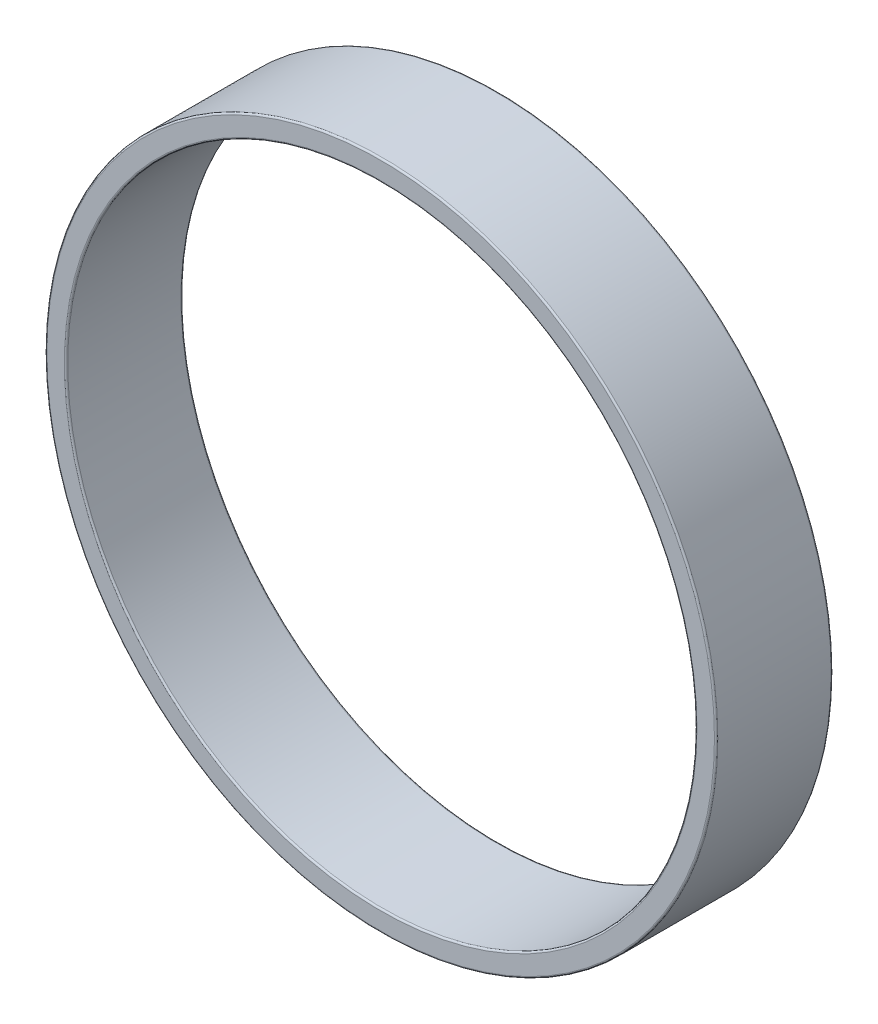
ISO-10303-21;
HEADER;
FILE_DESCRIPTION(('STEP AP214'),'2;1');
FILE_NAME('part.step','',(''),(''),'','','');
FILE_SCHEMA(('AUTOMOTIVE_DESIGN { 1 0 10303 214 1 1 1 1 }'));
ENDSEC;
DATA;
#1=APPLICATION_CONTEXT('core data for automotive mechanical design processes');
#2=APPLICATION_PROTOCOL_DEFINITION('international standard','automotive_design',2000,#1);
#3=PRODUCT_CONTEXT('',#1,'mechanical');
#4=PRODUCT('Part','Part','',(#3));
#5=PRODUCT_RELATED_PRODUCT_CATEGORY('part','',(#4));
#6=PRODUCT_DEFINITION_FORMATION('','',#4);
#7=PRODUCT_DEFINITION_CONTEXT('part definition',#1,'design');
#8=PRODUCT_DEFINITION('design','',#6,#7);
#9=PRODUCT_DEFINITION_SHAPE('','',#8);
#10=(LENGTH_UNIT() NAMED_UNIT(*) SI_UNIT(.MILLI.,.METRE.));
#11=(NAMED_UNIT(*) PLANE_ANGLE_UNIT() SI_UNIT($,.RADIAN.));
#12=(NAMED_UNIT(*) SI_UNIT($,.STERADIAN.) SOLID_ANGLE_UNIT());
#13=UNCERTAINTY_MEASURE_WITH_UNIT(LENGTH_MEASURE(1.E-05),#10,'distance_accuracy_value','');
#14=(GEOMETRIC_REPRESENTATION_CONTEXT(3) GLOBAL_UNCERTAINTY_ASSIGNED_CONTEXT((#13)) GLOBAL_UNIT_ASSIGNED_CONTEXT((#10,
#11,#12)) REPRESENTATION_CONTEXT('',''));
#15=CARTESIAN_POINT('',(0.,0.,0.));
#16=DIRECTION('',(0.,0.,1.));
#17=DIRECTION('',(1.,0.,0.));
#18=AXIS2_PLACEMENT_3D('',#15,#16,#17);
#19=CARTESIAN_POINT('',(0.,0.,28.));
#20=DIRECTION('',(0.,0.,1.));
#21=DIRECTION('',(1.,0.,0.));
#22=AXIS2_PLACEMENT_3D('',#19,#20,#21);
#23=PLANE('',#22);
#24=CARTESIAN_POINT('',(0.,0.,28.));
#25=DIRECTION('',(0.,0.,1.));
#26=DIRECTION('',(1.,0.,0.));
#27=AXIS2_PLACEMENT_3D('',#24,#25,#26);
#28=CIRCLE('',#27,75.9);
#29=CARTESIAN_POINT('',(75.9,0.,28.));
#30=VERTEX_POINT('',#29);
#31=EDGE_CURVE('E46',#30,#30,#28,.F.);
#32=ORIENTED_EDGE('',*,*,#31,.T.);
#33=EDGE_LOOP('',(#32));
#34=FACE_BOUND('',#33,.T.);
#35=CARTESIAN_POINT('',(0.,0.,28.));
#36=DIRECTION('',(0.,0.,1.));
#37=DIRECTION('',(1.,0.,0.));
#38=AXIS2_PLACEMENT_3D('',#35,#36,#37);
#39=CIRCLE('',#38,80.1);
#40=CARTESIAN_POINT('',(80.1,0.,28.));
#41=VERTEX_POINT('',#40);
#42=EDGE_CURVE('E50',#41,#41,#39,.T.);
#43=ORIENTED_EDGE('',*,*,#42,.T.);
#44=EDGE_LOOP('',(#43));
#45=FACE_BOUND('',#44,.T.);
#46=ADVANCED_FACE('F35',(#34,#45),#23,.T.);
#47=CARTESIAN_POINT('',(0.,0.,0.));
#48=DIRECTION('',(0.,0.,1.));
#49=DIRECTION('',(1.,0.,0.));
#50=AXIS2_PLACEMENT_3D('',#47,#48,#49);
#51=PLANE('',#50);
#52=CARTESIAN_POINT('',(0.,0.,0.));
#53=DIRECTION('',(0.,0.,1.));
#54=DIRECTION('',(1.,0.,0.));
#55=AXIS2_PLACEMENT_3D('',#52,#53,#54);
#56=CIRCLE('',#55,75.9);
#57=CARTESIAN_POINT('',(75.9,0.,0.));
#58=VERTEX_POINT('',#57);
#59=EDGE_CURVE('E61',#58,#58,#56,.T.);
#60=ORIENTED_EDGE('',*,*,#59,.T.);
#61=EDGE_LOOP('',(#60));
#62=FACE_BOUND('',#61,.T.);
#63=CARTESIAN_POINT('',(0.,0.,0.));
#64=DIRECTION('',(0.,0.,1.));
#65=DIRECTION('',(1.,0.,0.));
#66=AXIS2_PLACEMENT_3D('',#63,#64,#65);
#67=CIRCLE('',#66,80.1);
#68=CARTESIAN_POINT('',(80.1,0.,0.));
#69=VERTEX_POINT('',#68);
#70=EDGE_CURVE('E64',#69,#69,#67,.F.);
#71=ORIENTED_EDGE('',*,*,#70,.T.);
#72=EDGE_LOOP('',(#71));
#73=FACE_BOUND('',#72,.T.);
#74=ADVANCED_FACE('F68',(#62,#73),#51,.F.);
#75=CARTESIAN_POINT('',(0.,0.,28.));
#76=DIRECTION('',(0.,0.,-1.));
#77=DIRECTION('',(-1.,0.,0.));
#78=AXIS2_PLACEMENT_3D('',#75,#76,#77);
#79=CYLINDRICAL_SURFACE('',#78,80.5);
#80=CARTESIAN_POINT('',(0.,0.,0.400000000000001));
#81=DIRECTION('',(0.,0.,1.));
#82=DIRECTION('',(1.,0.,0.));
#83=AXIS2_PLACEMENT_3D('',#80,#81,#82);
#84=CIRCLE('',#83,80.5);
#85=CARTESIAN_POINT('',(80.5,0.,0.400000000000001));
#86=VERTEX_POINT('',#85);
#87=EDGE_CURVE('E10',#86,#86,#84,.T.);
#88=ORIENTED_EDGE('',*,*,#87,.T.);
#89=EDGE_LOOP('',(#88));
#90=FACE_BOUND('',#89,.T.);
#91=CARTESIAN_POINT('',(0.,0.,27.6));
#92=DIRECTION('',(0.,0.,1.));
#93=DIRECTION('',(1.,0.,0.));
#94=AXIS2_PLACEMENT_3D('',#91,#92,#93);
#95=CIRCLE('',#94,80.5);
#96=CARTESIAN_POINT('',(80.5,0.,27.6));
#97=VERTEX_POINT('',#96);
#98=EDGE_CURVE('E42',#97,#97,#95,.F.);
#99=ORIENTED_EDGE('',*,*,#98,.T.);
#100=EDGE_LOOP('',(#99));
#101=FACE_BOUND('',#100,.T.);
#102=ADVANCED_FACE('F88',(#90,#101),#79,.T.);
#103=CARTESIAN_POINT('',(0.,0.,28.));
#104=DIRECTION('',(0.,0.,-1.));
#105=DIRECTION('',(-1.,0.,0.));
#106=AXIS2_PLACEMENT_3D('',#103,#104,#105);
#107=CYLINDRICAL_SURFACE('',#106,75.5);
#108=CARTESIAN_POINT('',(0.,0.,0.400000000000001));
#109=DIRECTION('',(0.,0.,1.));
#110=DIRECTION('',(1.,0.,0.));
#111=AXIS2_PLACEMENT_3D('',#108,#109,#110);
#112=CIRCLE('',#111,75.5);
#113=CARTESIAN_POINT('',(75.5,0.,0.400000000000001));
#114=VERTEX_POINT('',#113);
#115=EDGE_CURVE('E55',#114,#114,#112,.F.);
#116=ORIENTED_EDGE('',*,*,#115,.T.);
#117=EDGE_LOOP('',(#116));
#118=FACE_BOUND('',#117,.T.);
#119=CARTESIAN_POINT('',(0.,0.,27.6));
#120=DIRECTION('',(0.,0.,1.));
#121=DIRECTION('',(1.,0.,0.));
#122=AXIS2_PLACEMENT_3D('',#119,#120,#121);
#123=CIRCLE('',#122,75.5);
#124=CARTESIAN_POINT('',(75.5,0.,27.6));
#125=VERTEX_POINT('',#124);
#126=EDGE_CURVE('E58',#125,#125,#123,.T.);
#127=ORIENTED_EDGE('',*,*,#126,.T.);
#128=EDGE_LOOP('',(#127));
#129=FACE_BOUND('',#128,.T.);
#130=ADVANCED_FACE('F93',(#118,#129),#107,.F.);
#131=CARTESIAN_POINT('',(0.,0.,0.400000000000001));
#132=DIRECTION('',(0.,0.,1.));
#133=DIRECTION('',(1.,0.,0.));
#134=AXIS2_PLACEMENT_3D('',#131,#132,#133);
#135=TOROIDAL_SURFACE('',#134,75.9,0.4);
#136=ORIENTED_EDGE('',*,*,#115,.F.);
#137=EDGE_LOOP('',(#136));
#138=FACE_BOUND('',#137,.T.);
#139=ORIENTED_EDGE('',*,*,#59,.F.);
#140=EDGE_LOOP('',(#139));
#141=FACE_BOUND('',#140,.T.);
#142=ADVANCED_FACE('F79',(#138,#141),#135,.T.);
#143=CARTESIAN_POINT('',(0.,0.,27.6));
#144=DIRECTION('',(0.,0.,1.));
#145=DIRECTION('',(1.,0.,0.));
#146=AXIS2_PLACEMENT_3D('',#143,#144,#145);
#147=TOROIDAL_SURFACE('',#146,75.9,0.4);
#148=ORIENTED_EDGE('',*,*,#31,.F.);
#149=EDGE_LOOP('',(#148));
#150=FACE_BOUND('',#149,.T.);
#151=ORIENTED_EDGE('',*,*,#126,.F.);
#152=EDGE_LOOP('',(#151));
#153=FACE_BOUND('',#152,.T.);
#154=ADVANCED_FACE('F73',(#150,#153),#147,.T.);
#155=CARTESIAN_POINT('',(0.,0.,0.400000000000001));
#156=DIRECTION('',(0.,0.,1.));
#157=DIRECTION('',(1.,0.,0.));
#158=AXIS2_PLACEMENT_3D('',#155,#156,#157);
#159=TOROIDAL_SURFACE('',#158,80.1,0.4);
#160=ORIENTED_EDGE('',*,*,#70,.F.);
#161=EDGE_LOOP('',(#160));
#162=FACE_BOUND('',#161,.T.);
#163=ORIENTED_EDGE('',*,*,#87,.F.);
#164=EDGE_LOOP('',(#163));
#165=FACE_BOUND('',#164,.T.);
#166=ADVANCED_FACE('F70',(#162,#165),#159,.T.);
#167=CARTESIAN_POINT('',(0.,0.,27.6));
#168=DIRECTION('',(0.,0.,1.));
#169=DIRECTION('',(1.,0.,0.));
#170=AXIS2_PLACEMENT_3D('',#167,#168,#169);
#171=TOROIDAL_SURFACE('',#170,80.1,0.4);
#172=ORIENTED_EDGE('',*,*,#98,.F.);
#173=EDGE_LOOP('',(#172));
#174=FACE_BOUND('',#173,.T.);
#175=ORIENTED_EDGE('',*,*,#42,.F.);
#176=EDGE_LOOP('',(#175));
#177=FACE_BOUND('',#176,.T.);
#178=ADVANCED_FACE('F37',(#174,#177),#171,.T.);
#179=CLOSED_SHELL('',(#46,#74,#102,#130,#142,#154,#166,#178));
#180=MANIFOLD_SOLID_BREP('B2',#179);
#181=ADVANCED_BREP_SHAPE_REPRESENTATION('',(#18,#180),#14);
#182=SHAPE_DEFINITION_REPRESENTATION(#9,#181);
ENDSEC;
END-ISO-10303-21;
